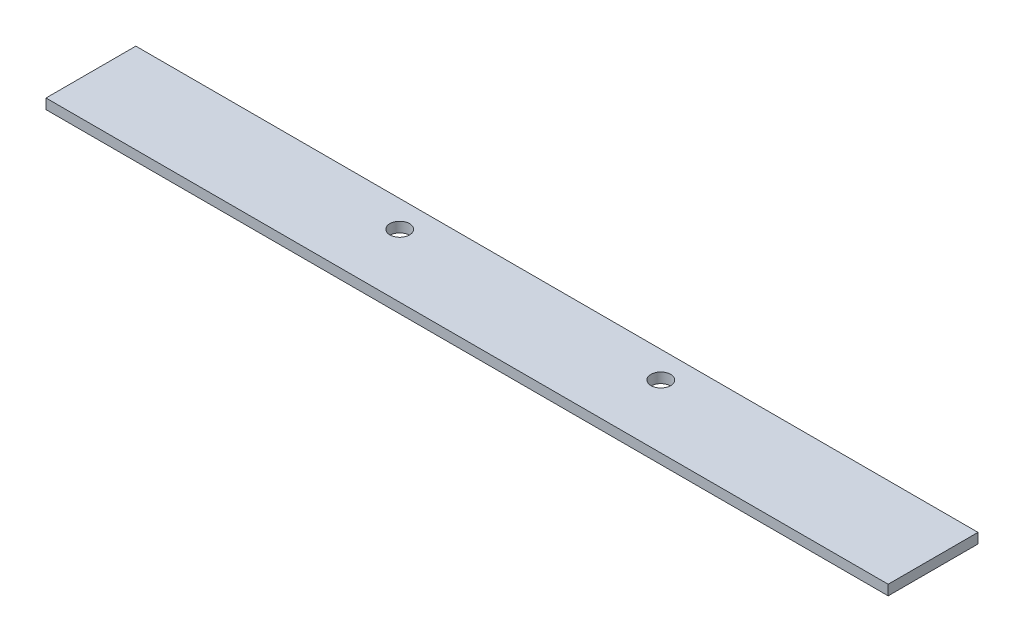
ISO-10303-21;
HEADER;
FILE_DESCRIPTION(('STEP AP214'),'2;1');
FILE_NAME('part.step','',(''),(''),'','','');
FILE_SCHEMA(('AUTOMOTIVE_DESIGN { 1 0 10303 214 1 1 1 1 }'));
ENDSEC;
DATA;
#1=APPLICATION_CONTEXT('core data for automotive mechanical design processes');
#2=APPLICATION_PROTOCOL_DEFINITION('international standard','automotive_design',2000,#1);
#3=PRODUCT_CONTEXT('',#1,'mechanical');
#4=PRODUCT('Part','Part','',(#3));
#5=PRODUCT_RELATED_PRODUCT_CATEGORY('part','',(#4));
#6=PRODUCT_DEFINITION_FORMATION('','',#4);
#7=PRODUCT_DEFINITION_CONTEXT('part definition',#1,'design');
#8=PRODUCT_DEFINITION('design','',#6,#7);
#9=PRODUCT_DEFINITION_SHAPE('','',#8);
#10=(LENGTH_UNIT() NAMED_UNIT(*) SI_UNIT(.MILLI.,.METRE.));
#11=(NAMED_UNIT(*) PLANE_ANGLE_UNIT() SI_UNIT($,.RADIAN.));
#12=(NAMED_UNIT(*) SI_UNIT($,.STERADIAN.) SOLID_ANGLE_UNIT());
#13=UNCERTAINTY_MEASURE_WITH_UNIT(LENGTH_MEASURE(1.E-05),#10,'distance_accuracy_value','');
#14=(GEOMETRIC_REPRESENTATION_CONTEXT(3) GLOBAL_UNCERTAINTY_ASSIGNED_CONTEXT((#13)) GLOBAL_UNIT_ASSIGNED_CONTEXT((#10,
#11,#12)) REPRESENTATION_CONTEXT('',''));
#15=CARTESIAN_POINT('',(0.,0.,0.));
#16=DIRECTION('',(0.,0.,1.));
#17=DIRECTION('',(1.,0.,0.));
#18=AXIS2_PLACEMENT_3D('',#15,#16,#17);
#19=CARTESIAN_POINT('',(75.,1.8,8.));
#20=DIRECTION('',(-1.,0.,0.));
#21=DIRECTION('',(0.,0.,1.));
#22=AXIS2_PLACEMENT_3D('',#19,#20,#21);
#23=PLANE('',#22);
#24=DIRECTION('',(0.,0.,-1.));
#25=VECTOR('',#24,1.);
#26=CARTESIAN_POINT('',(75.,0.,8.));
#27=LINE('',#26,#25);
#28=CARTESIAN_POINT('',(75.,0.,8.));
#29=VERTEX_POINT('',#28);
#30=CARTESIAN_POINT('',(75.,0.,-8.));
#31=VERTEX_POINT('',#30);
#32=EDGE_CURVE('E95',#29,#31,#27,.T.);
#33=ORIENTED_EDGE('',*,*,#32,.T.);
#34=DIRECTION('',(0.,-1.,0.));
#35=VECTOR('',#34,1.);
#36=CARTESIAN_POINT('',(75.,1.8,-8.));
#37=LINE('',#36,#35);
#38=CARTESIAN_POINT('',(75.,1.8,-8.));
#39=VERTEX_POINT('',#38);
#40=EDGE_CURVE('E11',#39,#31,#37,.T.);
#41=ORIENTED_EDGE('',*,*,#40,.F.);
#42=DIRECTION('',(0.,0.,-1.));
#43=VECTOR('',#42,1.);
#44=CARTESIAN_POINT('',(75.,1.8,8.));
#45=LINE('',#44,#43);
#46=CARTESIAN_POINT('',(75.,1.8,8.));
#47=VERTEX_POINT('',#46);
#48=EDGE_CURVE('E83',#47,#39,#45,.T.);
#49=ORIENTED_EDGE('',*,*,#48,.F.);
#50=DIRECTION('',(0.,-1.,0.));
#51=VECTOR('',#50,1.);
#52=CARTESIAN_POINT('',(75.,1.8,8.));
#53=LINE('',#52,#51);
#54=EDGE_CURVE('E91',#47,#29,#53,.T.);
#55=ORIENTED_EDGE('',*,*,#54,.T.);
#56=EDGE_LOOP('',(#33,#41,#49,#55));
#57=FACE_BOUND('',#56,.T.);
#58=ADVANCED_FACE('F32',(#57),#23,.F.);
#59=CARTESIAN_POINT('',(-75.,1.8,-8.));
#60=DIRECTION('',(0.,0.,1.));
#61=DIRECTION('',(1.,0.,0.));
#62=AXIS2_PLACEMENT_3D('',#59,#60,#61);
#63=PLANE('',#62);
#64=DIRECTION('',(-1.,0.,0.));
#65=VECTOR('',#64,1.);
#66=CARTESIAN_POINT('',(-75.,0.,-8.));
#67=LINE('',#66,#65);
#68=CARTESIAN_POINT('',(-75.,0.,-8.));
#69=VERTEX_POINT('',#68);
#70=EDGE_CURVE('E87',#31,#69,#67,.T.);
#71=ORIENTED_EDGE('',*,*,#70,.T.);
#72=DIRECTION('',(0.,-1.,0.));
#73=VECTOR('',#72,1.);
#74=CARTESIAN_POINT('',(-75.,1.8,-8.));
#75=LINE('',#74,#73);
#76=CARTESIAN_POINT('',(-75.,1.8,-8.));
#77=VERTEX_POINT('',#76);
#78=EDGE_CURVE('E40',#77,#69,#75,.T.);
#79=ORIENTED_EDGE('',*,*,#78,.F.);
#80=DIRECTION('',(-1.,0.,0.));
#81=VECTOR('',#80,1.);
#82=CARTESIAN_POINT('',(-75.,1.8,-8.));
#83=LINE('',#82,#81);
#84=EDGE_CURVE('E78',#39,#77,#83,.T.);
#85=ORIENTED_EDGE('',*,*,#84,.F.);
#86=ORIENTED_EDGE('',*,*,#40,.T.);
#87=EDGE_LOOP('',(#71,#79,#85,#86));
#88=FACE_BOUND('',#87,.T.);
#89=ADVANCED_FACE('F86',(#88),#63,.F.);
#90=CARTESIAN_POINT('',(-75.,1.8,8.));
#91=DIRECTION('',(1.,0.,0.));
#92=DIRECTION('',(0.,0.,-1.));
#93=AXIS2_PLACEMENT_3D('',#90,#91,#92);
#94=PLANE('',#93);
#95=DIRECTION('',(0.,0.,1.));
#96=VECTOR('',#95,1.);
#97=CARTESIAN_POINT('',(-75.,0.,8.));
#98=LINE('',#97,#96);
#99=CARTESIAN_POINT('',(-75.,0.,8.));
#100=VERTEX_POINT('',#99);
#101=EDGE_CURVE('E65',#69,#100,#98,.T.);
#102=ORIENTED_EDGE('',*,*,#101,.T.);
#103=DIRECTION('',(0.,-1.,0.));
#104=VECTOR('',#103,1.);
#105=CARTESIAN_POINT('',(-75.,1.8,8.));
#106=LINE('',#105,#104);
#107=CARTESIAN_POINT('',(-75.,1.8,8.));
#108=VERTEX_POINT('',#107);
#109=EDGE_CURVE('E88',#108,#100,#106,.T.);
#110=ORIENTED_EDGE('',*,*,#109,.F.);
#111=DIRECTION('',(0.,0.,1.));
#112=VECTOR('',#111,1.);
#113=CARTESIAN_POINT('',(-75.,1.8,8.));
#114=LINE('',#113,#112);
#115=EDGE_CURVE('E81',#77,#108,#114,.T.);
#116=ORIENTED_EDGE('',*,*,#115,.F.);
#117=ORIENTED_EDGE('',*,*,#78,.T.);
#118=EDGE_LOOP('',(#102,#110,#116,#117));
#119=FACE_BOUND('',#118,.T.);
#120=ADVANCED_FACE('F89',(#119),#94,.F.);
#121=CARTESIAN_POINT('',(-75.,1.8,8.));
#122=DIRECTION('',(0.,0.,-1.));
#123=DIRECTION('',(-1.,0.,0.));
#124=AXIS2_PLACEMENT_3D('',#121,#122,#123);
#125=PLANE('',#124);
#126=DIRECTION('',(1.,0.,0.));
#127=VECTOR('',#126,1.);
#128=CARTESIAN_POINT('',(-75.,0.,8.));
#129=LINE('',#128,#127);
#130=EDGE_CURVE('E71',#100,#29,#129,.T.);
#131=ORIENTED_EDGE('',*,*,#130,.T.);
#132=ORIENTED_EDGE('',*,*,#54,.F.);
#133=DIRECTION('',(1.,0.,0.));
#134=VECTOR('',#133,1.);
#135=CARTESIAN_POINT('',(-75.,1.8,8.));
#136=LINE('',#135,#134);
#137=EDGE_CURVE('E48',#108,#47,#136,.T.);
#138=ORIENTED_EDGE('',*,*,#137,.F.);
#139=ORIENTED_EDGE('',*,*,#109,.T.);
#140=EDGE_LOOP('',(#131,#132,#138,#139));
#141=FACE_BOUND('',#140,.T.);
#142=ADVANCED_FACE('F103',(#141),#125,.F.);
#143=CARTESIAN_POINT('',(0.,1.8,0.));
#144=DIRECTION('',(0.,-1.,0.));
#145=DIRECTION('',(0.,0.,-1.));
#146=AXIS2_PLACEMENT_3D('',#143,#144,#145);
#147=PLANE('',#146);
#148=CARTESIAN_POINT('',(-23.25,1.8,-3.25));
#149=DIRECTION('',(0.,1.,0.));
#150=DIRECTION('',(0.,0.,1.));
#151=AXIS2_PLACEMENT_3D('',#148,#149,#150);
#152=CIRCLE('',#151,1.75);
#153=CARTESIAN_POINT('',(-23.25,1.8,-1.5));
#154=VERTEX_POINT('',#153);
#155=EDGE_CURVE('E115',#154,#154,#152,.T.);
#156=ORIENTED_EDGE('',*,*,#155,.F.);
#157=EDGE_LOOP('',(#156));
#158=FACE_BOUND('',#157,.T.);
#159=CARTESIAN_POINT('',(23.25,1.8,-3.25));
#160=DIRECTION('',(0.,1.,0.));
#161=DIRECTION('',(0.,0.,1.));
#162=AXIS2_PLACEMENT_3D('',#159,#160,#161);
#163=CIRCLE('',#162,1.75);
#164=CARTESIAN_POINT('',(23.25,1.8,-1.5));
#165=VERTEX_POINT('',#164);
#166=EDGE_CURVE('E109',#165,#165,#163,.T.);
#167=ORIENTED_EDGE('',*,*,#166,.F.);
#168=EDGE_LOOP('',(#167));
#169=FACE_BOUND('',#168,.T.);
#170=ORIENTED_EDGE('',*,*,#48,.T.);
#171=ORIENTED_EDGE('',*,*,#84,.T.);
#172=ORIENTED_EDGE('',*,*,#115,.T.);
#173=ORIENTED_EDGE('',*,*,#137,.T.);
#174=EDGE_LOOP('',(#170,#171,#172,#173));
#175=FACE_BOUND('',#174,.T.);
#176=ADVANCED_FACE('F79',(#158,#169,#175),#147,.F.);
#177=CARTESIAN_POINT('',(0.,0.,0.));
#178=DIRECTION('',(0.,-1.,0.));
#179=DIRECTION('',(0.,0.,-1.));
#180=AXIS2_PLACEMENT_3D('',#177,#178,#179);
#181=PLANE('',#180);
#182=CARTESIAN_POINT('',(-23.25,0.,-3.25));
#183=DIRECTION('',(0.,1.,0.));
#184=DIRECTION('',(0.,0.,1.));
#185=AXIS2_PLACEMENT_3D('',#182,#183,#184);
#186=CIRCLE('',#185,1.75);
#187=CARTESIAN_POINT('',(-23.25,0.,-1.5));
#188=VERTEX_POINT('',#187);
#189=EDGE_CURVE('E98',#188,#188,#186,.T.);
#190=ORIENTED_EDGE('',*,*,#189,.T.);
#191=EDGE_LOOP('',(#190));
#192=FACE_BOUND('',#191,.T.);
#193=CARTESIAN_POINT('',(23.25,0.,-3.25));
#194=DIRECTION('',(0.,1.,0.));
#195=DIRECTION('',(0.,0.,1.));
#196=AXIS2_PLACEMENT_3D('',#193,#194,#195);
#197=CIRCLE('',#196,1.75);
#198=CARTESIAN_POINT('',(23.25,0.,-1.5));
#199=VERTEX_POINT('',#198);
#200=EDGE_CURVE('E112',#199,#199,#197,.T.);
#201=ORIENTED_EDGE('',*,*,#200,.T.);
#202=EDGE_LOOP('',(#201));
#203=FACE_BOUND('',#202,.T.);
#204=ORIENTED_EDGE('',*,*,#32,.F.);
#205=ORIENTED_EDGE('',*,*,#130,.F.);
#206=ORIENTED_EDGE('',*,*,#101,.F.);
#207=ORIENTED_EDGE('',*,*,#70,.F.);
#208=EDGE_LOOP('',(#204,#205,#206,#207));
#209=FACE_BOUND('',#208,.T.);
#210=ADVANCED_FACE('F106',(#192,#203,#209),#181,.T.);
#211=CARTESIAN_POINT('',(23.25,0.,-3.25));
#212=DIRECTION('',(0.,1.,0.));
#213=DIRECTION('',(0.,0.,1.));
#214=AXIS2_PLACEMENT_3D('',#211,#212,#213);
#215=CYLINDRICAL_SURFACE('',#214,1.75);
#216=ORIENTED_EDGE('',*,*,#200,.F.);
#217=EDGE_LOOP('',(#216));
#218=FACE_BOUND('',#217,.T.);
#219=ORIENTED_EDGE('',*,*,#166,.T.);
#220=EDGE_LOOP('',(#219));
#221=FACE_BOUND('',#220,.T.);
#222=ADVANCED_FACE('F126',(#218,#221),#215,.F.);
#223=CARTESIAN_POINT('',(-23.25,0.,-3.25));
#224=DIRECTION('',(0.,1.,0.));
#225=DIRECTION('',(0.,0.,1.));
#226=AXIS2_PLACEMENT_3D('',#223,#224,#225);
#227=CYLINDRICAL_SURFACE('',#226,1.75);
#228=ORIENTED_EDGE('',*,*,#189,.F.);
#229=EDGE_LOOP('',(#228));
#230=FACE_BOUND('',#229,.T.);
#231=ORIENTED_EDGE('',*,*,#155,.T.);
#232=EDGE_LOOP('',(#231));
#233=FACE_BOUND('',#232,.T.);
#234=ADVANCED_FACE('F123',(#230,#233),#227,.F.);
#235=CLOSED_SHELL('',(#58,#89,#120,#142,#176,#210,#222,#234));
#236=MANIFOLD_SOLID_BREP('B2',#235);
#237=ADVANCED_BREP_SHAPE_REPRESENTATION('',(#18,#236),#14);
#238=SHAPE_DEFINITION_REPRESENTATION(#9,#237);
ENDSEC;
END-ISO-10303-21;
